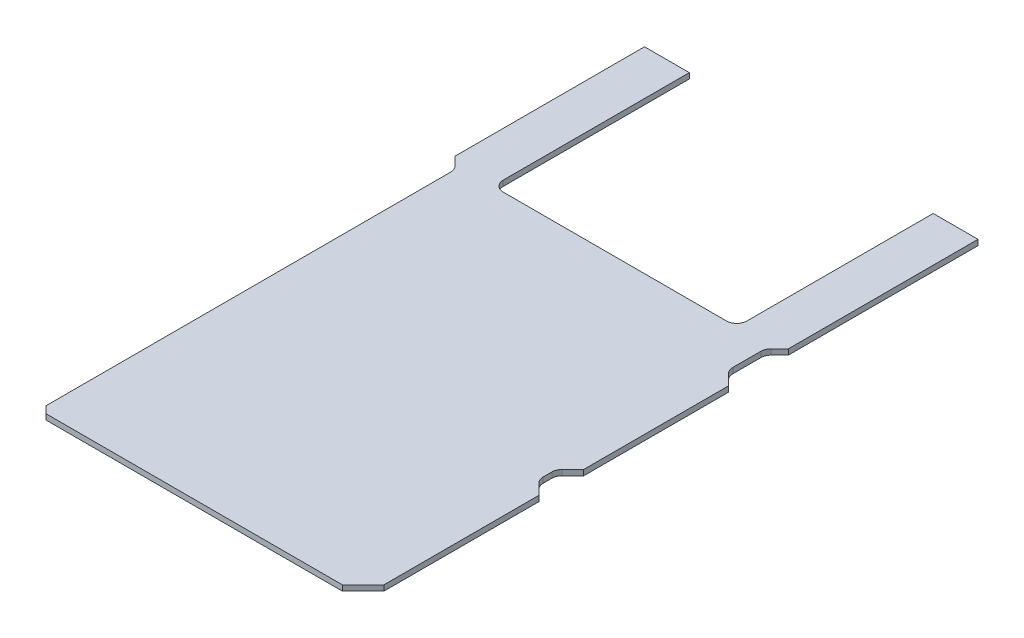
ISO-10303-21;
HEADER;
FILE_DESCRIPTION(('STEP AP214'),'2;1');
FILE_NAME('part.step','',(''),(''),'','','');
FILE_SCHEMA(('AUTOMOTIVE_DESIGN { 1 0 10303 214 1 1 1 1 }'));
ENDSEC;
DATA;
#1=APPLICATION_CONTEXT('core data for automotive mechanical design processes');
#2=APPLICATION_PROTOCOL_DEFINITION('international standard','automotive_design',2000,#1);
#3=PRODUCT_CONTEXT('',#1,'mechanical');
#4=PRODUCT('Part','Part','',(#3));
#5=PRODUCT_RELATED_PRODUCT_CATEGORY('part','',(#4));
#6=PRODUCT_DEFINITION_FORMATION('','',#4);
#7=PRODUCT_DEFINITION_CONTEXT('part definition',#1,'design');
#8=PRODUCT_DEFINITION('design','',#6,#7);
#9=PRODUCT_DEFINITION_SHAPE('','',#8);
#10=(LENGTH_UNIT() NAMED_UNIT(*) SI_UNIT(.MILLI.,.METRE.));
#11=(NAMED_UNIT(*) PLANE_ANGLE_UNIT() SI_UNIT($,.RADIAN.));
#12=(NAMED_UNIT(*) SI_UNIT($,.STERADIAN.) SOLID_ANGLE_UNIT());
#13=UNCERTAINTY_MEASURE_WITH_UNIT(LENGTH_MEASURE(1.E-05),#10,'distance_accuracy_value','');
#14=(GEOMETRIC_REPRESENTATION_CONTEXT(3) GLOBAL_UNCERTAINTY_ASSIGNED_CONTEXT((#13)) GLOBAL_UNIT_ASSIGNED_CONTEXT((#10,
#11,#12)) REPRESENTATION_CONTEXT('',''));
#15=CARTESIAN_POINT('',(0.,0.,0.));
#16=DIRECTION('',(0.,0.,1.));
#17=DIRECTION('',(1.,0.,0.));
#18=AXIS2_PLACEMENT_3D('',#15,#16,#17);
#19=CARTESIAN_POINT('',(45.,1.6,-88.5));
#20=DIRECTION('',(0.,0.,1.));
#21=DIRECTION('',(1.,0.,0.));
#22=AXIS2_PLACEMENT_3D('',#19,#20,#21);
#23=PLANE('',#22);
#24=DIRECTION('',(-1.,0.,0.));
#25=VECTOR('',#24,1.);
#26=CARTESIAN_POINT('',(45.,1.6,-88.5));
#27=LINE('',#26,#25);
#28=CARTESIAN_POINT('',(-35.3743,1.60000000000001,-88.5));
#29=VERTEX_POINT('',#28);
#30=CARTESIAN_POINT('',(-48.3743,1.6,-88.5));
#31=VERTEX_POINT('',#30);
#32=EDGE_CURVE('E221',#29,#31,#27,.T.);
#33=ORIENTED_EDGE('',*,*,#32,.F.);
#34=DIRECTION('',(0.,-1.,0.));
#35=VECTOR('',#34,1.);
#36=CARTESIAN_POINT('',(-35.3743,1.60000000000001,-88.5));
#37=LINE('',#36,#35);
#38=CARTESIAN_POINT('',(-35.3743,0.,-88.5));
#39=VERTEX_POINT('',#38);
#40=EDGE_CURVE('E232',#29,#39,#37,.T.);
#41=ORIENTED_EDGE('',*,*,#40,.T.);
#42=DIRECTION('',(-1.,0.,0.));
#43=VECTOR('',#42,1.);
#44=CARTESIAN_POINT('',(45.,0.,-88.5));
#45=LINE('',#44,#43);
#46=CARTESIAN_POINT('',(-48.3743,0.,-88.5));
#47=VERTEX_POINT('',#46);
#48=EDGE_CURVE('E261',#39,#47,#45,.T.);
#49=ORIENTED_EDGE('',*,*,#48,.T.);
#50=DIRECTION('',(0.,-1.,0.));
#51=VECTOR('',#50,1.);
#52=CARTESIAN_POINT('',(-48.3743,60.0717436115942,-88.5));
#53=LINE('',#52,#51);
#54=EDGE_CURVE('E242',#31,#47,#53,.T.);
#55=ORIENTED_EDGE('',*,*,#54,.F.);
#56=EDGE_LOOP('',(#33,#41,#49,#55));
#57=FACE_BOUND('',#56,.T.);
#58=ADVANCED_FACE('F39',(#57),#23,.F.);
#59=CARTESIAN_POINT('',(45.,1.6,88.5));
#60=DIRECTION('',(-1.,0.,0.));
#61=DIRECTION('',(0.,0.,1.));
#62=AXIS2_PLACEMENT_3D('',#59,#60,#61);
#63=PLANE('',#62);
#64=DIRECTION('',(0.,0.,-1.));
#65=VECTOR('',#64,1.);
#66=CARTESIAN_POINT('',(45.,0.,88.5));
#67=LINE('',#66,#65);
#68=CARTESIAN_POINT('',(45.,0.,34.2573593128807));
#69=VERTEX_POINT('',#68);
#70=CARTESIAN_POINT('',(45.,0.,31.7426406871193));
#71=VERTEX_POINT('',#70);
#72=EDGE_CURVE('E258',#69,#71,#67,.T.);
#73=ORIENTED_EDGE('',*,*,#72,.T.);
#74=DIRECTION('',(0.,1.,0.));
#75=VECTOR('',#74,1.);
#76=CARTESIAN_POINT('',(45.,1.6,31.7426406871193));
#77=LINE('',#76,#75);
#78=CARTESIAN_POINT('',(45.,1.6,31.7426406871193));
#79=VERTEX_POINT('',#78);
#80=EDGE_CURVE('E286',#71,#79,#77,.T.);
#81=ORIENTED_EDGE('',*,*,#80,.T.);
#82=DIRECTION('',(0.,0.,-1.));
#83=VECTOR('',#82,1.);
#84=CARTESIAN_POINT('',(45.,1.6,88.5));
#85=LINE('',#84,#83);
#86=CARTESIAN_POINT('',(45.,1.6,34.2573593128807));
#87=VERTEX_POINT('',#86);
#88=EDGE_CURVE('E245',#87,#79,#85,.T.);
#89=ORIENTED_EDGE('',*,*,#88,.F.);
#90=DIRECTION('',(0.,1.,0.));
#91=VECTOR('',#90,1.);
#92=CARTESIAN_POINT('',(45.,1.6,34.2573593128807));
#93=LINE('',#92,#91);
#94=EDGE_CURVE('E284',#87,#69,#93,.F.);
#95=ORIENTED_EDGE('',*,*,#94,.T.);
#96=EDGE_LOOP('',(#73,#81,#89,#95));
#97=FACE_BOUND('',#96,.T.);
#98=ADVANCED_FACE('F458',(#97),#63,.F.);
#99=CARTESIAN_POINT('',(45.,1.6,-20.7426406871193));
#100=VERTEX_POINT('',#99);
#101=CARTESIAN_POINT('',(45.,1.6,-28.8830593128806));
#102=VERTEX_POINT('',#101);
#103=EDGE_CURVE('E250',#100,#102,#85,.T.);
#104=ORIENTED_EDGE('',*,*,#103,.F.);
#105=DIRECTION('',(0.,1.,0.));
#106=VECTOR('',#105,1.);
#107=CARTESIAN_POINT('',(45.,1.6,-20.7426406871193));
#108=LINE('',#107,#106);
#109=CARTESIAN_POINT('',(45.,0.,-20.7426406871193));
#110=VERTEX_POINT('',#109);
#111=EDGE_CURVE('E282',#100,#110,#108,.F.);
#112=ORIENTED_EDGE('',*,*,#111,.T.);
#113=CARTESIAN_POINT('',(45.,0.,-28.8830593128806));
#114=VERTEX_POINT('',#113);
#115=EDGE_CURVE('E256',#110,#114,#67,.T.);
#116=ORIENTED_EDGE('',*,*,#115,.T.);
#117=DIRECTION('',(0.,-1.,0.));
#118=VECTOR('',#117,1.);
#119=CARTESIAN_POINT('',(45.,1.6,-28.8830593128806));
#120=LINE('',#119,#118);
#121=EDGE_CURVE('E280',#114,#102,#120,.F.);
#122=ORIENTED_EDGE('',*,*,#121,.T.);
#123=EDGE_LOOP('',(#104,#112,#116,#122));
#124=FACE_BOUND('',#123,.T.);
#125=ADVANCED_FACE('F349',(#124),#63,.F.);
#126=CARTESIAN_POINT('',(-45.,1.6,88.5));
#127=DIRECTION('',(1.,0.,0.));
#128=DIRECTION('',(0.,0.,-1.));
#129=AXIS2_PLACEMENT_3D('',#126,#127,#128);
#130=PLANE('',#129);
#131=DIRECTION('',(0.,0.,1.));
#132=VECTOR('',#131,1.);
#133=CARTESIAN_POINT('',(-45.,1.6,88.5));
#134=LINE('',#133,#132);
#135=CARTESIAN_POINT('',(-45.,1.6,-28.8830593128807));
#136=VERTEX_POINT('',#135);
#137=CARTESIAN_POINT('',(-45.,1.6,88.5));
#138=VERTEX_POINT('',#137);
#139=EDGE_CURVE('E265',#136,#138,#134,.T.);
#140=ORIENTED_EDGE('',*,*,#139,.F.);
#141=DIRECTION('',(0.,-1.,0.));
#142=VECTOR('',#141,1.);
#143=CARTESIAN_POINT('',(-45.,1.6,-28.8830593128807));
#144=LINE('',#143,#142);
#145=CARTESIAN_POINT('',(-45.,0.,-28.8830593128807));
#146=VERTEX_POINT('',#145);
#147=EDGE_CURVE('E297',#136,#146,#144,.T.);
#148=ORIENTED_EDGE('',*,*,#147,.T.);
#149=DIRECTION('',(0.,0.,1.));
#150=VECTOR('',#149,1.);
#151=CARTESIAN_POINT('',(-45.,0.,88.5));
#152=LINE('',#151,#150);
#153=CARTESIAN_POINT('',(-45.,0.,88.5));
#154=VERTEX_POINT('',#153);
#155=EDGE_CURVE('E254',#146,#154,#152,.T.);
#156=ORIENTED_EDGE('',*,*,#155,.T.);
#157=DIRECTION('',(0.,-1.,0.));
#158=VECTOR('',#157,1.);
#159=CARTESIAN_POINT('',(-45.,1.6,88.5));
#160=LINE('',#159,#158);
#161=EDGE_CURVE('E248',#138,#154,#160,.T.);
#162=ORIENTED_EDGE('',*,*,#161,.F.);
#163=EDGE_LOOP('',(#140,#148,#156,#162));
#164=FACE_BOUND('',#163,.T.);
#165=ADVANCED_FACE('F430',(#164),#130,.F.);
#166=CARTESIAN_POINT('',(48.3743,0.,-88.5));
#167=VERTEX_POINT('',#166);
#168=CARTESIAN_POINT('',(35.3743,0.,-88.5));
#169=VERTEX_POINT('',#168);
#170=EDGE_CURVE('E262',#167,#169,#45,.T.);
#171=ORIENTED_EDGE('',*,*,#170,.T.);
#172=DIRECTION('',(0.,-1.,0.));
#173=VECTOR('',#172,1.);
#174=CARTESIAN_POINT('',(35.3743,1.60000000000001,-88.5));
#175=LINE('',#174,#173);
#176=CARTESIAN_POINT('',(35.3743,1.60000000000001,-88.5));
#177=VERTEX_POINT('',#176);
#178=EDGE_CURVE('E238',#177,#169,#175,.T.);
#179=ORIENTED_EDGE('',*,*,#178,.F.);
#180=CARTESIAN_POINT('',(48.3743,1.60000000000001,-88.5));
#181=VERTEX_POINT('',#180);
#182=EDGE_CURVE('E244',#181,#177,#27,.T.);
#183=ORIENTED_EDGE('',*,*,#182,.F.);
#184=DIRECTION('',(0.,-1.,0.));
#185=VECTOR('',#184,1.);
#186=CARTESIAN_POINT('',(48.3743,60.0717436115942,-88.5));
#187=LINE('',#186,#185);
#188=EDGE_CURVE('E406',#181,#167,#187,.T.);
#189=ORIENTED_EDGE('',*,*,#188,.T.);
#190=EDGE_LOOP('',(#171,#179,#183,#189));
#191=FACE_BOUND('',#190,.T.);
#192=ADVANCED_FACE('F521',(#191),#23,.F.);
#193=CARTESIAN_POINT('',(0.,1.6,0.));
#194=DIRECTION('',(0.,1.,0.));
#195=DIRECTION('',(0.,0.,1.));
#196=AXIS2_PLACEMENT_3D('',#193,#194,#195);
#197=PLANE('',#196);
#198=DIRECTION('',(-1.,0.,0.));
#199=VECTOR('',#198,1.);
#200=CARTESIAN_POINT('',(-35.3743,1.60000000000001,-31.5));
#201=LINE('',#200,#199);
#202=CARTESIAN_POINT('',(32.3743,1.60000000000001,-31.5));
#203=VERTEX_POINT('',#202);
#204=CARTESIAN_POINT('',(-32.3743,1.60000000000001,-31.5));
#205=VERTEX_POINT('',#204);
#206=EDGE_CURVE('E239',#203,#205,#201,.T.);
#207=ORIENTED_EDGE('',*,*,#206,.T.);
#208=CARTESIAN_POINT('',(-32.3743,1.6,-34.5));
#209=DIRECTION('',(0.,1.,0.));
#210=DIRECTION('',(0.,0.,1.));
#211=AXIS2_PLACEMENT_3D('',#208,#209,#210);
#212=CIRCLE('',#211,3.);
#213=CARTESIAN_POINT('',(-35.3743,1.60000000000001,-34.5));
#214=VERTEX_POINT('',#213);
#215=EDGE_CURVE('E224',#205,#214,#212,.F.);
#216=ORIENTED_EDGE('',*,*,#215,.T.);
#217=DIRECTION('',(0.,0.,-1.));
#218=VECTOR('',#217,1.);
#219=CARTESIAN_POINT('',(-35.3743,1.60000000000001,-88.5));
#220=LINE('',#219,#218);
#221=EDGE_CURVE('E215',#214,#29,#220,.T.);
#222=ORIENTED_EDGE('',*,*,#221,.T.);
#223=ORIENTED_EDGE('',*,*,#32,.T.);
#224=DIRECTION('',(0.,0.,1.));
#225=VECTOR('',#224,1.);
#226=CARTESIAN_POINT('',(-48.3743,1.6,0.));
#227=LINE('',#226,#225);
#228=CARTESIAN_POINT('',(-48.3743,1.60000000000001,-33.5));
#229=VERTEX_POINT('',#228);
#230=EDGE_CURVE('E257',#31,#229,#227,.T.);
#231=ORIENTED_EDGE('',*,*,#230,.T.);
#232=DIRECTION('',(-0.707106781186544,0.,-0.707106781186551));
#233=VECTOR('',#232,1.);
#234=CARTESIAN_POINT('',(-7.43715000000023,1.6,7.43715000000016));
#235=LINE('',#234,#233);
#236=CARTESIAN_POINT('',(-45.8786796564404,1.6,-31.0043796564403));
#237=VERTEX_POINT('',#236);
#238=EDGE_CURVE('E419',#237,#229,#235,.T.);
#239=ORIENTED_EDGE('',*,*,#238,.F.);
#240=CARTESIAN_POINT('',(-48.,1.6,-28.8830593128807));
#241=DIRECTION('',(0.,1.,0.));
#242=DIRECTION('',(0.,0.,1.));
#243=AXIS2_PLACEMENT_3D('',#240,#241,#242);
#244=CIRCLE('',#243,3.);
#245=EDGE_CURVE('E11',#237,#136,#244,.F.);
#246=ORIENTED_EDGE('',*,*,#245,.T.);
#247=ORIENTED_EDGE('',*,*,#139,.T.);
#248=DIRECTION('',(0.707106781186546,0.,0.707106781186549));
#249=VECTOR('',#248,1.);
#250=CARTESIAN_POINT('',(-66.7500000000001,1.6,66.7499999999999));
#251=LINE('',#250,#249);
#252=CARTESIAN_POINT('',(-43.,1.6,90.5));
#253=VERTEX_POINT('',#252);
#254=EDGE_CURVE('E398',#138,#253,#251,.T.);
#255=ORIENTED_EDGE('',*,*,#254,.T.);
#256=DIRECTION('',(1.,0.,0.));
#257=VECTOR('',#256,1.);
#258=CARTESIAN_POINT('',(0.,1.6,90.5));
#259=LINE('',#258,#257);
#260=CARTESIAN_POINT('',(43.,1.6,90.5));
#261=VERTEX_POINT('',#260);
#262=EDGE_CURVE('E374',#253,#261,#259,.T.);
#263=ORIENTED_EDGE('',*,*,#262,.T.);
#264=DIRECTION('',(0.707106781186545,0.,-0.70710678118655));
#265=VECTOR('',#264,1.);
#266=CARTESIAN_POINT('',(66.7500000000002,1.6,66.7499999999997));
#267=LINE('',#266,#265);
#268=CARTESIAN_POINT('',(49.,1.6,84.5));
#269=VERTEX_POINT('',#268);
#270=EDGE_CURVE('E396',#261,#269,#267,.T.);
#271=ORIENTED_EDGE('',*,*,#270,.T.);
#272=DIRECTION('',(0.,0.,-1.));
#273=VECTOR('',#272,1.);
#274=CARTESIAN_POINT('',(49.,1.6,0.));
#275=LINE('',#274,#273);
#276=CARTESIAN_POINT('',(49.,1.6,39.5));
#277=VERTEX_POINT('',#276);
#278=EDGE_CURVE('E379',#269,#277,#275,.T.);
#279=ORIENTED_EDGE('',*,*,#278,.T.);
#280=DIRECTION('',(-0.707106781186546,0.,-0.707106781186549));
#281=VECTOR('',#280,1.);
#282=CARTESIAN_POINT('',(4.75000000000012,1.6,-4.75000000000009));
#283=LINE('',#282,#281);
#284=CARTESIAN_POINT('',(45.8786796564404,1.6,36.3786796564404));
#285=VERTEX_POINT('',#284);
#286=EDGE_CURVE('E380',#277,#285,#283,.T.);
#287=ORIENTED_EDGE('',*,*,#286,.T.);
#288=CARTESIAN_POINT('',(48.,1.6,34.2573593128807));
#289=DIRECTION('',(0.,1.,0.));
#290=DIRECTION('',(0.,0.,1.));
#291=AXIS2_PLACEMENT_3D('',#288,#289,#290);
#292=CIRCLE('',#291,3.);
#293=EDGE_CURVE('E316',#285,#87,#292,.F.);
#294=ORIENTED_EDGE('',*,*,#293,.T.);
#295=ORIENTED_EDGE('',*,*,#88,.T.);
#296=CARTESIAN_POINT('',(48.,1.6,31.7426406871193));
#297=DIRECTION('',(0.,1.,0.));
#298=DIRECTION('',(0.,0.,1.));
#299=AXIS2_PLACEMENT_3D('',#296,#297,#298);
#300=CIRCLE('',#299,3.);
#301=CARTESIAN_POINT('',(45.8786796564404,1.6,29.6213203435596));
#302=VERTEX_POINT('',#301);
#303=EDGE_CURVE('E312',#79,#302,#300,.F.);
#304=ORIENTED_EDGE('',*,*,#303,.T.);
#305=DIRECTION('',(0.707106781186549,0.,-0.707106781186546));
#306=VECTOR('',#305,1.);
#307=CARTESIAN_POINT('',(37.7499999999999,1.6,37.7500000000001));
#308=LINE('',#307,#306);
#309=CARTESIAN_POINT('',(49.,1.6,26.5));
#310=VERTEX_POINT('',#309);
#311=EDGE_CURVE('E470',#302,#310,#308,.T.);
#312=ORIENTED_EDGE('',*,*,#311,.T.);
#313=DIRECTION('',(0.,0.,-1.));
#314=VECTOR('',#313,1.);
#315=CARTESIAN_POINT('',(49.,1.6,0.));
#316=LINE('',#315,#314);
#317=CARTESIAN_POINT('',(49.,1.6,-15.5));
#318=VERTEX_POINT('',#317);
#319=EDGE_CURVE('E480',#310,#318,#316,.T.);
#320=ORIENTED_EDGE('',*,*,#319,.T.);
#321=DIRECTION('',(-0.707106781186546,0.,-0.707106781186549));
#322=VECTOR('',#321,1.);
#323=CARTESIAN_POINT('',(32.2500000000001,1.6,-32.25));
#324=LINE('',#323,#322);
#325=CARTESIAN_POINT('',(45.8786796564404,1.6,-18.6213203435596));
#326=VERTEX_POINT('',#325);
#327=EDGE_CURVE('E478',#318,#326,#324,.T.);
#328=ORIENTED_EDGE('',*,*,#327,.T.);
#329=CARTESIAN_POINT('',(48.,1.6,-20.7426406871193));
#330=DIRECTION('',(0.,1.,0.));
#331=DIRECTION('',(0.,0.,1.));
#332=AXIS2_PLACEMENT_3D('',#329,#330,#331);
#333=CIRCLE('',#332,3.);
#334=EDGE_CURVE('E308',#326,#100,#333,.F.);
#335=ORIENTED_EDGE('',*,*,#334,.T.);
#336=ORIENTED_EDGE('',*,*,#103,.T.);
#337=CARTESIAN_POINT('',(48.,1.6,-28.8830593128806));
#338=DIRECTION('',(0.,1.,0.));
#339=DIRECTION('',(0.,0.,1.));
#340=AXIS2_PLACEMENT_3D('',#337,#338,#339);
#341=CIRCLE('',#340,3.);
#342=CARTESIAN_POINT('',(45.8786796564404,1.6,-31.0043796564403));
#343=VERTEX_POINT('',#342);
#344=EDGE_CURVE('E322',#102,#343,#341,.F.);
#345=ORIENTED_EDGE('',*,*,#344,.T.);
#346=DIRECTION('',(0.707106781186551,0.,-0.707106781186544));
#347=VECTOR('',#346,1.);
#348=CARTESIAN_POINT('',(7.43714999999979,1.6,7.43714999999987));
#349=LINE('',#348,#347);
#350=CARTESIAN_POINT('',(48.3743,1.60000000000001,-33.4999999999999));
#351=VERTEX_POINT('',#350);
#352=EDGE_CURVE('E327',#343,#351,#349,.T.);
#353=ORIENTED_EDGE('',*,*,#352,.T.);
#354=DIRECTION('',(0.,0.,1.));
#355=VECTOR('',#354,1.);
#356=CARTESIAN_POINT('',(48.3743,1.6,0.));
#357=LINE('',#356,#355);
#358=EDGE_CURVE('E408',#181,#351,#357,.T.);
#359=ORIENTED_EDGE('',*,*,#358,.F.);
#360=ORIENTED_EDGE('',*,*,#182,.T.);
#361=DIRECTION('',(0.,0.,1.));
#362=VECTOR('',#361,1.);
#363=CARTESIAN_POINT('',(35.3743,1.60000000000001,-88.5));
#364=LINE('',#363,#362);
#365=CARTESIAN_POINT('',(35.3743,1.60000000000001,-34.5));
#366=VERTEX_POINT('',#365);
#367=EDGE_CURVE('E228',#177,#366,#364,.T.);
#368=ORIENTED_EDGE('',*,*,#367,.T.);
#369=CARTESIAN_POINT('',(32.3743,1.6,-34.5));
#370=DIRECTION('',(0.,1.,0.));
#371=DIRECTION('',(0.,0.,1.));
#372=AXIS2_PLACEMENT_3D('',#369,#370,#371);
#373=CIRCLE('',#372,3.);
#374=EDGE_CURVE('E306',#366,#203,#373,.F.);
#375=ORIENTED_EDGE('',*,*,#374,.T.);
#376=EDGE_LOOP('',(#207,#216,#222,#223,#231,#239,#246,#247,#255,#263,#271,#279,#287,#294,#295,
#304,#312,#320,#328,#335,#336,#345,#353,#359,#360,#368,#375));
#377=FACE_BOUND('',#376,.T.);
#378=ADVANCED_FACE('F218',(#377),#197,.T.);
#379=CARTESIAN_POINT('',(0.,0.,0.));
#380=DIRECTION('',(0.,1.,0.));
#381=DIRECTION('',(0.,0.,1.));
#382=AXIS2_PLACEMENT_3D('',#379,#380,#381);
#383=PLANE('',#382);
#384=ORIENTED_EDGE('',*,*,#48,.F.);
#385=DIRECTION('',(0.,0.,-1.));
#386=VECTOR('',#385,1.);
#387=CARTESIAN_POINT('',(-35.3743,0.,-88.5));
#388=LINE('',#387,#386);
#389=CARTESIAN_POINT('',(-35.3743,0.,-34.5));
#390=VERTEX_POINT('',#389);
#391=EDGE_CURVE('E235',#390,#39,#388,.T.);
#392=ORIENTED_EDGE('',*,*,#391,.F.);
#393=CARTESIAN_POINT('',(-32.3743,0.,-34.5));
#394=DIRECTION('',(0.,1.,0.));
#395=DIRECTION('',(0.,0.,1.));
#396=AXIS2_PLACEMENT_3D('',#393,#394,#395);
#397=CIRCLE('',#396,3.);
#398=CARTESIAN_POINT('',(-32.3743,0.,-31.5));
#399=VERTEX_POINT('',#398);
#400=EDGE_CURVE('E301',#390,#399,#397,.T.);
#401=ORIENTED_EDGE('',*,*,#400,.T.);
#402=DIRECTION('',(-1.,0.,0.));
#403=VECTOR('',#402,1.);
#404=CARTESIAN_POINT('',(-35.3743,0.,-31.5));
#405=LINE('',#404,#403);
#406=CARTESIAN_POINT('',(32.3743,0.,-31.5));
#407=VERTEX_POINT('',#406);
#408=EDGE_CURVE('E229',#407,#399,#405,.T.);
#409=ORIENTED_EDGE('',*,*,#408,.F.);
#410=CARTESIAN_POINT('',(32.3743,0.,-34.5));
#411=DIRECTION('',(0.,1.,0.));
#412=DIRECTION('',(0.,0.,1.));
#413=AXIS2_PLACEMENT_3D('',#410,#411,#412);
#414=CIRCLE('',#413,3.);
#415=CARTESIAN_POINT('',(35.3743,0.,-34.5));
#416=VERTEX_POINT('',#415);
#417=EDGE_CURVE('E304',#407,#416,#414,.T.);
#418=ORIENTED_EDGE('',*,*,#417,.T.);
#419=DIRECTION('',(0.,0.,1.));
#420=VECTOR('',#419,1.);
#421=CARTESIAN_POINT('',(35.3743,0.,-88.5));
#422=LINE('',#421,#420);
#423=EDGE_CURVE('E492',#169,#416,#422,.T.);
#424=ORIENTED_EDGE('',*,*,#423,.F.);
#425=ORIENTED_EDGE('',*,*,#170,.F.);
#426=DIRECTION('',(0.,0.,1.));
#427=VECTOR('',#426,1.);
#428=CARTESIAN_POINT('',(48.3743,0.,0.));
#429=LINE('',#428,#427);
#430=CARTESIAN_POINT('',(48.3743,0.,-33.4999999999999));
#431=VERTEX_POINT('',#430);
#432=EDGE_CURVE('E339',#167,#431,#429,.T.);
#433=ORIENTED_EDGE('',*,*,#432,.T.);
#434=DIRECTION('',(0.707106781186551,0.,-0.707106781186544));
#435=VECTOR('',#434,1.);
#436=CARTESIAN_POINT('',(7.43714999999979,0.,7.43714999999987));
#437=LINE('',#436,#435);
#438=CARTESIAN_POINT('',(45.8786796564404,0.,-31.0043796564403));
#439=VERTEX_POINT('',#438);
#440=EDGE_CURVE('E347',#439,#431,#437,.T.);
#441=ORIENTED_EDGE('',*,*,#440,.F.);
#442=CARTESIAN_POINT('',(48.,0.,-28.8830593128806));
#443=DIRECTION('',(0.,1.,0.));
#444=DIRECTION('',(0.,0.,1.));
#445=AXIS2_PLACEMENT_3D('',#442,#443,#444);
#446=CIRCLE('',#445,3.);
#447=EDGE_CURVE('E320',#439,#114,#446,.T.);
#448=ORIENTED_EDGE('',*,*,#447,.T.);
#449=ORIENTED_EDGE('',*,*,#115,.F.);
#450=CARTESIAN_POINT('',(48.,0.,-20.7426406871193));
#451=DIRECTION('',(0.,1.,0.));
#452=DIRECTION('',(0.,0.,1.));
#453=AXIS2_PLACEMENT_3D('',#450,#451,#452);
#454=CIRCLE('',#453,3.);
#455=CARTESIAN_POINT('',(45.8786796564404,0.,-18.6213203435596));
#456=VERTEX_POINT('',#455);
#457=EDGE_CURVE('E310',#110,#456,#454,.T.);
#458=ORIENTED_EDGE('',*,*,#457,.T.);
#459=DIRECTION('',(0.707106781186546,0.,0.707106781186549));
#460=VECTOR('',#459,1.);
#461=CARTESIAN_POINT('',(32.2500000000001,0.,-32.25));
#462=LINE('',#461,#460);
#463=CARTESIAN_POINT('',(49.,0.,-15.5));
#464=VERTEX_POINT('',#463);
#465=EDGE_CURVE('E355',#456,#464,#462,.T.);
#466=ORIENTED_EDGE('',*,*,#465,.T.);
#467=DIRECTION('',(0.,0.,1.));
#468=VECTOR('',#467,1.);
#469=CARTESIAN_POINT('',(49.,0.,0.));
#470=LINE('',#469,#468);
#471=CARTESIAN_POINT('',(49.,0.,26.5));
#472=VERTEX_POINT('',#471);
#473=EDGE_CURVE('E364',#464,#472,#470,.T.);
#474=ORIENTED_EDGE('',*,*,#473,.T.);
#475=DIRECTION('',(-0.707106781186549,0.,0.707106781186546));
#476=VECTOR('',#475,1.);
#477=CARTESIAN_POINT('',(37.7499999999999,0.,37.7500000000001));
#478=LINE('',#477,#476);
#479=CARTESIAN_POINT('',(45.8786796564404,0.,29.6213203435596));
#480=VERTEX_POINT('',#479);
#481=EDGE_CURVE('E368',#472,#480,#478,.T.);
#482=ORIENTED_EDGE('',*,*,#481,.T.);
#483=CARTESIAN_POINT('',(48.,0.,31.7426406871193));
#484=DIRECTION('',(0.,1.,0.));
#485=DIRECTION('',(0.,0.,1.));
#486=AXIS2_PLACEMENT_3D('',#483,#484,#485);
#487=CIRCLE('',#486,3.);
#488=EDGE_CURVE('E314',#480,#71,#487,.T.);
#489=ORIENTED_EDGE('',*,*,#488,.T.);
#490=ORIENTED_EDGE('',*,*,#72,.F.);
#491=CARTESIAN_POINT('',(48.,0.,34.2573593128807));
#492=DIRECTION('',(0.,1.,0.));
#493=DIRECTION('',(0.,0.,1.));
#494=AXIS2_PLACEMENT_3D('',#491,#492,#493);
#495=CIRCLE('',#494,3.);
#496=CARTESIAN_POINT('',(45.8786796564404,0.,36.3786796564404));
#497=VERTEX_POINT('',#496);
#498=EDGE_CURVE('E318',#69,#497,#495,.T.);
#499=ORIENTED_EDGE('',*,*,#498,.T.);
#500=DIRECTION('',(0.707106781186546,0.,0.707106781186549));
#501=VECTOR('',#500,1.);
#502=CARTESIAN_POINT('',(4.75000000000012,0.,-4.75000000000009));
#503=LINE('',#502,#501);
#504=CARTESIAN_POINT('',(49.,0.,39.5));
#505=VERTEX_POINT('',#504);
#506=EDGE_CURVE('E373',#497,#505,#503,.T.);
#507=ORIENTED_EDGE('',*,*,#506,.T.);
#508=DIRECTION('',(0.,0.,1.));
#509=VECTOR('',#508,1.);
#510=CARTESIAN_POINT('',(49.,0.,0.));
#511=LINE('',#510,#509);
#512=CARTESIAN_POINT('',(49.,0.,84.5));
#513=VERTEX_POINT('',#512);
#514=EDGE_CURVE('E375',#505,#513,#511,.T.);
#515=ORIENTED_EDGE('',*,*,#514,.T.);
#516=DIRECTION('',(-0.707106781186545,0.,0.70710678118655));
#517=VECTOR('',#516,1.);
#518=CARTESIAN_POINT('',(66.7500000000002,0.,66.7499999999997));
#519=LINE('',#518,#517);
#520=CARTESIAN_POINT('',(43.,0.,90.5));
#521=VERTEX_POINT('',#520);
#522=EDGE_CURVE('E393',#513,#521,#519,.T.);
#523=ORIENTED_EDGE('',*,*,#522,.T.);
#524=DIRECTION('',(-1.,0.,0.));
#525=VECTOR('',#524,1.);
#526=CARTESIAN_POINT('',(0.,0.,90.5));
#527=LINE('',#526,#525);
#528=CARTESIAN_POINT('',(-43.,0.,90.5));
#529=VERTEX_POINT('',#528);
#530=EDGE_CURVE('E390',#521,#529,#527,.T.);
#531=ORIENTED_EDGE('',*,*,#530,.T.);
#532=DIRECTION('',(-0.707106781186546,0.,-0.707106781186549));
#533=VECTOR('',#532,1.);
#534=CARTESIAN_POINT('',(-66.7500000000001,0.,66.7499999999999));
#535=LINE('',#534,#533);
#536=EDGE_CURVE('E387',#529,#154,#535,.T.);
#537=ORIENTED_EDGE('',*,*,#536,.T.);
#538=ORIENTED_EDGE('',*,*,#155,.F.);
#539=CARTESIAN_POINT('',(-48.,0.,-28.8830593128807));
#540=DIRECTION('',(0.,1.,0.));
#541=DIRECTION('',(0.,0.,1.));
#542=AXIS2_PLACEMENT_3D('',#539,#540,#541);
#543=CIRCLE('',#542,3.);
#544=CARTESIAN_POINT('',(-45.8786796564404,0.,-31.0043796564403));
#545=VERTEX_POINT('',#544);
#546=EDGE_CURVE('E47',#146,#545,#543,.T.);
#547=ORIENTED_EDGE('',*,*,#546,.T.);
#548=DIRECTION('',(-0.707106781186544,0.,-0.707106781186551));
#549=VECTOR('',#548,1.);
#550=CARTESIAN_POINT('',(-7.43715000000023,0.,7.43715000000016));
#551=LINE('',#550,#549);
#552=CARTESIAN_POINT('',(-48.3743,0.,-33.5));
#553=VERTEX_POINT('',#552);
#554=EDGE_CURVE('E413',#545,#553,#551,.T.);
#555=ORIENTED_EDGE('',*,*,#554,.T.);
#556=DIRECTION('',(0.,0.,1.));
#557=VECTOR('',#556,1.);
#558=CARTESIAN_POINT('',(-48.3743,0.,0.));
#559=LINE('',#558,#557);
#560=EDGE_CURVE('E416',#47,#553,#559,.T.);
#561=ORIENTED_EDGE('',*,*,#560,.F.);
#562=EDGE_LOOP('',(#384,#392,#401,#409,#418,#424,#425,#433,#441,#448,#449,#458,#466,#474,#482,
#489,#490,#499,#507,#515,#523,#531,#537,#538,#547,#555,#561));
#563=FACE_BOUND('',#562,.T.);
#564=ADVANCED_FACE('F344',(#563),#383,.F.);
#565=CARTESIAN_POINT('',(-48.3743,60.0717436115942,0.));
#566=DIRECTION('',(1.,0.,0.));
#567=DIRECTION('',(0.,0.,-1.));
#568=AXIS2_PLACEMENT_3D('',#565,#566,#567);
#569=PLANE('',#568);
#570=ORIENTED_EDGE('',*,*,#230,.F.);
#571=ORIENTED_EDGE('',*,*,#54,.T.);
#572=ORIENTED_EDGE('',*,*,#560,.T.);
#573=DIRECTION('',(0.,-1.,0.));
#574=VECTOR('',#573,1.);
#575=CARTESIAN_POINT('',(-48.3743,60.0717436115942,-33.5));
#576=LINE('',#575,#574);
#577=EDGE_CURVE('E415',#229,#553,#576,.T.);
#578=ORIENTED_EDGE('',*,*,#577,.F.);
#579=EDGE_LOOP('',(#570,#571,#572,#578));
#580=FACE_BOUND('',#579,.T.);
#581=ADVANCED_FACE('F551',(#580),#569,.F.);
#582=CARTESIAN_POINT('',(-7.43715000000023,60.0717436115942,7.43715000000016));
#583=DIRECTION('',(-0.707106781186551,0.,0.707106781186544));
#584=DIRECTION('',(0.707106781186544,0.,0.707106781186551));
#585=AXIS2_PLACEMENT_3D('',#582,#583,#584);
#586=PLANE('',#585);
#587=ORIENTED_EDGE('',*,*,#554,.F.);
#588=DIRECTION('',(0.,-1.,0.));
#589=VECTOR('',#588,1.);
#590=CARTESIAN_POINT('',(-45.8786796564404,60.0717436115942,-31.0043796564403));
#591=LINE('',#590,#589);
#592=EDGE_CURVE('E60',#545,#237,#591,.F.);
#593=ORIENTED_EDGE('',*,*,#592,.T.);
#594=ORIENTED_EDGE('',*,*,#238,.T.);
#595=ORIENTED_EDGE('',*,*,#577,.T.);
#596=EDGE_LOOP('',(#587,#593,#594,#595));
#597=FACE_BOUND('',#596,.T.);
#598=ADVANCED_FACE('F545',(#597),#586,.T.);
#599=CARTESIAN_POINT('',(7.43714999999979,60.0717436115942,7.43714999999987));
#600=DIRECTION('',(-0.707106781186544,0.,-0.707106781186551));
#601=DIRECTION('',(-0.707106781186551,0.,0.707106781186544));
#602=AXIS2_PLACEMENT_3D('',#599,#600,#601);
#603=PLANE('',#602);
#604=ORIENTED_EDGE('',*,*,#352,.F.);
#605=DIRECTION('',(0.,-1.,0.));
#606=VECTOR('',#605,1.);
#607=CARTESIAN_POINT('',(45.8786796564404,0.,-31.0043796564403));
#608=LINE('',#607,#606);
#609=EDGE_CURVE('E294',#343,#439,#608,.T.);
#610=ORIENTED_EDGE('',*,*,#609,.T.);
#611=ORIENTED_EDGE('',*,*,#440,.T.);
#612=DIRECTION('',(0.,-1.,0.));
#613=VECTOR('',#612,1.);
#614=CARTESIAN_POINT('',(48.3743,60.0717436115942,-33.4999999999999));
#615=LINE('',#614,#613);
#616=EDGE_CURVE('E338',#351,#431,#615,.T.);
#617=ORIENTED_EDGE('',*,*,#616,.F.);
#618=EDGE_LOOP('',(#604,#610,#611,#617));
#619=FACE_BOUND('',#618,.T.);
#620=ADVANCED_FACE('F335',(#619),#603,.F.);
#621=CARTESIAN_POINT('',(48.3743,60.0717436115942,0.));
#622=DIRECTION('',(1.,0.,0.));
#623=DIRECTION('',(0.,0.,-1.));
#624=AXIS2_PLACEMENT_3D('',#621,#622,#623);
#625=PLANE('',#624);
#626=ORIENTED_EDGE('',*,*,#188,.F.);
#627=ORIENTED_EDGE('',*,*,#358,.T.);
#628=ORIENTED_EDGE('',*,*,#616,.T.);
#629=ORIENTED_EDGE('',*,*,#432,.F.);
#630=EDGE_LOOP('',(#626,#627,#628,#629));
#631=FACE_BOUND('',#630,.T.);
#632=ADVANCED_FACE('F537',(#631),#625,.T.);
#633=CARTESIAN_POINT('',(0.,-90.0222194794151,90.5));
#634=DIRECTION('',(0.,0.,1.));
#635=DIRECTION('',(1.,0.,0.));
#636=AXIS2_PLACEMENT_3D('',#633,#634,#635);
#637=PLANE('',#636);
#638=ORIENTED_EDGE('',*,*,#530,.F.);
#639=DIRECTION('',(0.,1.,0.));
#640=VECTOR('',#639,1.);
#641=CARTESIAN_POINT('',(43.,-90.0222194794151,90.5));
#642=LINE('',#641,#640);
#643=EDGE_CURVE('E401',#521,#261,#642,.T.);
#644=ORIENTED_EDGE('',*,*,#643,.T.);
#645=ORIENTED_EDGE('',*,*,#262,.F.);
#646=DIRECTION('',(0.,1.,0.));
#647=VECTOR('',#646,1.);
#648=CARTESIAN_POINT('',(-43.,-90.0222194794151,90.5));
#649=LINE('',#648,#647);
#650=EDGE_CURVE('E391',#529,#253,#649,.T.);
#651=ORIENTED_EDGE('',*,*,#650,.F.);
#652=EDGE_LOOP('',(#638,#644,#645,#651));
#653=FACE_BOUND('',#652,.T.);
#654=ADVANCED_FACE('F438',(#653),#637,.T.);
#655=CARTESIAN_POINT('',(-66.7500000000001,-90.0222194794151,66.7499999999999));
#656=DIRECTION('',(-0.707106781186549,0.,0.707106781186546));
#657=DIRECTION('',(0.707106781186546,0.,0.707106781186549));
#658=AXIS2_PLACEMENT_3D('',#655,#656,#657);
#659=PLANE('',#658);
#660=ORIENTED_EDGE('',*,*,#536,.F.);
#661=ORIENTED_EDGE('',*,*,#650,.T.);
#662=ORIENTED_EDGE('',*,*,#254,.F.);
#663=ORIENTED_EDGE('',*,*,#161,.T.);
#664=EDGE_LOOP('',(#660,#661,#662,#663));
#665=FACE_BOUND('',#664,.T.);
#666=ADVANCED_FACE('F433',(#665),#659,.T.);
#667=CARTESIAN_POINT('',(66.7500000000002,-90.0222194794151,66.7499999999997));
#668=DIRECTION('',(0.70710678118655,0.,0.707106781186545));
#669=DIRECTION('',(0.707106781186545,0.,-0.70710678118655));
#670=AXIS2_PLACEMENT_3D('',#667,#668,#669);
#671=PLANE('',#670);
#672=ORIENTED_EDGE('',*,*,#522,.F.);
#673=DIRECTION('',(0.,1.,0.));
#674=VECTOR('',#673,1.);
#675=CARTESIAN_POINT('',(49.,-90.0222194794151,84.5));
#676=LINE('',#675,#674);
#677=EDGE_CURVE('E366',#513,#269,#676,.T.);
#678=ORIENTED_EDGE('',*,*,#677,.T.);
#679=ORIENTED_EDGE('',*,*,#270,.F.);
#680=ORIENTED_EDGE('',*,*,#643,.F.);
#681=EDGE_LOOP('',(#672,#678,#679,#680));
#682=FACE_BOUND('',#681,.T.);
#683=ADVANCED_FACE('F444',(#682),#671,.T.);
#684=CARTESIAN_POINT('',(49.,-90.0222194794151,0.));
#685=DIRECTION('',(1.,0.,0.));
#686=DIRECTION('',(0.,0.,-1.));
#687=AXIS2_PLACEMENT_3D('',#684,#685,#686);
#688=PLANE('',#687);
#689=ORIENTED_EDGE('',*,*,#514,.F.);
#690=DIRECTION('',(0.,1.,0.));
#691=VECTOR('',#690,1.);
#692=CARTESIAN_POINT('',(49.,-90.0222194794151,39.5));
#693=LINE('',#692,#691);
#694=EDGE_CURVE('E363',#505,#277,#693,.T.);
#695=ORIENTED_EDGE('',*,*,#694,.T.);
#696=ORIENTED_EDGE('',*,*,#278,.F.);
#697=ORIENTED_EDGE('',*,*,#677,.F.);
#698=EDGE_LOOP('',(#689,#695,#696,#697));
#699=FACE_BOUND('',#698,.T.);
#700=ADVANCED_FACE('F447',(#699),#688,.T.);
#701=CARTESIAN_POINT('',(4.75000000000012,-90.0222194794151,-4.75000000000009));
#702=DIRECTION('',(0.707106781186549,0.,-0.707106781186546));
#703=DIRECTION('',(-0.707106781186546,0.,-0.707106781186549));
#704=AXIS2_PLACEMENT_3D('',#701,#702,#703);
#705=PLANE('',#704);
#706=ORIENTED_EDGE('',*,*,#506,.F.);
#707=DIRECTION('',(0.,1.,0.));
#708=VECTOR('',#707,1.);
#709=CARTESIAN_POINT('',(45.8786796564404,-90.0222194794151,36.3786796564404));
#710=LINE('',#709,#708);
#711=EDGE_CURVE('E291',#497,#285,#710,.T.);
#712=ORIENTED_EDGE('',*,*,#711,.T.);
#713=ORIENTED_EDGE('',*,*,#286,.F.);
#714=ORIENTED_EDGE('',*,*,#694,.F.);
#715=EDGE_LOOP('',(#706,#712,#713,#714));
#716=FACE_BOUND('',#715,.T.);
#717=ADVANCED_FACE('F452',(#716),#705,.T.);
#718=CARTESIAN_POINT('',(49.,-90.0222194794151,0.));
#719=DIRECTION('',(1.,0.,0.));
#720=DIRECTION('',(0.,0.,-1.));
#721=AXIS2_PLACEMENT_3D('',#718,#719,#720);
#722=PLANE('',#721);
#723=ORIENTED_EDGE('',*,*,#473,.F.);
#724=DIRECTION('',(0.,1.,0.));
#725=VECTOR('',#724,1.);
#726=CARTESIAN_POINT('',(49.,-90.0222194794151,-15.5));
#727=LINE('',#726,#725);
#728=EDGE_CURVE('E362',#464,#318,#727,.T.);
#729=ORIENTED_EDGE('',*,*,#728,.T.);
#730=ORIENTED_EDGE('',*,*,#319,.F.);
#731=DIRECTION('',(0.,1.,0.));
#732=VECTOR('',#731,1.);
#733=CARTESIAN_POINT('',(49.,-90.0222194794151,26.5));
#734=LINE('',#733,#732);
#735=EDGE_CURVE('E476',#472,#310,#734,.T.);
#736=ORIENTED_EDGE('',*,*,#735,.F.);
#737=EDGE_LOOP('',(#723,#729,#730,#736));
#738=FACE_BOUND('',#737,.T.);
#739=ADVANCED_FACE('F581',(#738),#722,.T.);
#740=CARTESIAN_POINT('',(37.7499999999999,-90.0222194794151,37.7500000000001));
#741=DIRECTION('',(0.707106781186546,0.,0.707106781186549));
#742=DIRECTION('',(0.707106781186549,0.,-0.707106781186546));
#743=AXIS2_PLACEMENT_3D('',#740,#741,#742);
#744=PLANE('',#743);
#745=ORIENTED_EDGE('',*,*,#311,.F.);
#746=DIRECTION('',(0.,1.,0.));
#747=VECTOR('',#746,1.);
#748=CARTESIAN_POINT('',(45.8786796564404,-90.0222194794151,29.6213203435596));
#749=LINE('',#748,#747);
#750=EDGE_CURVE('E289',#302,#480,#749,.F.);
#751=ORIENTED_EDGE('',*,*,#750,.T.);
#752=ORIENTED_EDGE('',*,*,#481,.F.);
#753=ORIENTED_EDGE('',*,*,#735,.T.);
#754=EDGE_LOOP('',(#745,#751,#752,#753));
#755=FACE_BOUND('',#754,.T.);
#756=ADVANCED_FACE('F473',(#755),#744,.T.);
#757=CARTESIAN_POINT('',(32.2500000000001,-90.0222194794151,-32.25));
#758=DIRECTION('',(0.707106781186549,0.,-0.707106781186546));
#759=DIRECTION('',(-0.707106781186546,0.,-0.707106781186549));
#760=AXIS2_PLACEMENT_3D('',#757,#758,#759);
#761=PLANE('',#760);
#762=ORIENTED_EDGE('',*,*,#465,.F.);
#763=DIRECTION('',(0.,1.,0.));
#764=VECTOR('',#763,1.);
#765=CARTESIAN_POINT('',(45.8786796564404,-90.0222194794151,-18.6213203435596));
#766=LINE('',#765,#764);
#767=EDGE_CURVE('E277',#456,#326,#766,.T.);
#768=ORIENTED_EDGE('',*,*,#767,.T.);
#769=ORIENTED_EDGE('',*,*,#327,.F.);
#770=ORIENTED_EDGE('',*,*,#728,.F.);
#771=EDGE_LOOP('',(#762,#768,#769,#770));
#772=FACE_BOUND('',#771,.T.);
#773=ADVANCED_FACE('F359',(#772),#761,.T.);
#774=CARTESIAN_POINT('',(-35.3743,1.60000000000001,-88.5));
#775=DIRECTION('',(-1.,0.,0.));
#776=DIRECTION('',(0.,0.,1.));
#777=AXIS2_PLACEMENT_3D('',#774,#775,#776);
#778=PLANE('',#777);
#779=ORIENTED_EDGE('',*,*,#221,.F.);
#780=DIRECTION('',(0.,-1.,0.));
#781=VECTOR('',#780,1.);
#782=CARTESIAN_POINT('',(-35.3743,0.,-34.5));
#783=LINE('',#782,#781);
#784=EDGE_CURVE('E268',#214,#390,#783,.T.);
#785=ORIENTED_EDGE('',*,*,#784,.T.);
#786=ORIENTED_EDGE('',*,*,#391,.T.);
#787=ORIENTED_EDGE('',*,*,#40,.F.);
#788=EDGE_LOOP('',(#779,#785,#786,#787));
#789=FACE_BOUND('',#788,.T.);
#790=ADVANCED_FACE('F233',(#789),#778,.F.);
#791=CARTESIAN_POINT('',(-35.3743,1.60000000000001,-31.5));
#792=DIRECTION('',(0.,0.,1.));
#793=DIRECTION('',(1.,0.,0.));
#794=AXIS2_PLACEMENT_3D('',#791,#792,#793);
#795=PLANE('',#794);
#796=ORIENTED_EDGE('',*,*,#408,.T.);
#797=DIRECTION('',(0.,-1.,0.));
#798=VECTOR('',#797,1.);
#799=CARTESIAN_POINT('',(-32.3743,1.60000000000001,-31.5));
#800=LINE('',#799,#798);
#801=EDGE_CURVE('E273',#399,#205,#800,.F.);
#802=ORIENTED_EDGE('',*,*,#801,.T.);
#803=ORIENTED_EDGE('',*,*,#206,.F.);
#804=DIRECTION('',(0.,-1.,0.));
#805=VECTOR('',#804,1.);
#806=CARTESIAN_POINT('',(32.3743,0.,-31.5));
#807=LINE('',#806,#805);
#808=EDGE_CURVE('E270',#203,#407,#807,.T.);
#809=ORIENTED_EDGE('',*,*,#808,.T.);
#810=EDGE_LOOP('',(#796,#802,#803,#809));
#811=FACE_BOUND('',#810,.T.);
#812=ADVANCED_FACE('F505',(#811),#795,.F.);
#813=CARTESIAN_POINT('',(35.3743,1.60000000000001,-88.5));
#814=DIRECTION('',(1.,0.,0.));
#815=DIRECTION('',(0.,0.,-1.));
#816=AXIS2_PLACEMENT_3D('',#813,#814,#815);
#817=PLANE('',#816);
#818=ORIENTED_EDGE('',*,*,#423,.T.);
#819=DIRECTION('',(0.,-1.,0.));
#820=VECTOR('',#819,1.);
#821=CARTESIAN_POINT('',(35.3743,1.60000000000001,-34.5));
#822=LINE('',#821,#820);
#823=EDGE_CURVE('E275',#416,#366,#822,.F.);
#824=ORIENTED_EDGE('',*,*,#823,.T.);
#825=ORIENTED_EDGE('',*,*,#367,.F.);
#826=ORIENTED_EDGE('',*,*,#178,.T.);
#827=EDGE_LOOP('',(#818,#824,#825,#826));
#828=FACE_BOUND('',#827,.T.);
#829=ADVANCED_FACE('F510',(#828),#817,.F.);
#830=CARTESIAN_POINT('',(-32.3743,1.60000000000001,-34.5));
#831=DIRECTION('',(0.,1.,0.));
#832=DIRECTION('',(0.,0.,1.));
#833=AXIS2_PLACEMENT_3D('',#830,#831,#832);
#834=CYLINDRICAL_SURFACE('',#833,3.);
#835=ORIENTED_EDGE('',*,*,#215,.F.);
#836=ORIENTED_EDGE('',*,*,#801,.F.);
#837=ORIENTED_EDGE('',*,*,#400,.F.);
#838=ORIENTED_EDGE('',*,*,#784,.F.);
#839=EDGE_LOOP('',(#835,#836,#837,#838));
#840=FACE_BOUND('',#839,.T.);
#841=ADVANCED_FACE('F508',(#840),#834,.F.);
#842=CARTESIAN_POINT('',(32.3743,1.60000000000001,-34.5));
#843=DIRECTION('',(0.,1.,0.));
#844=DIRECTION('',(0.,0.,1.));
#845=AXIS2_PLACEMENT_3D('',#842,#843,#844);
#846=CYLINDRICAL_SURFACE('',#845,3.);
#847=ORIENTED_EDGE('',*,*,#374,.F.);
#848=ORIENTED_EDGE('',*,*,#823,.F.);
#849=ORIENTED_EDGE('',*,*,#417,.F.);
#850=ORIENTED_EDGE('',*,*,#808,.F.);
#851=EDGE_LOOP('',(#847,#848,#849,#850));
#852=FACE_BOUND('',#851,.T.);
#853=ADVANCED_FACE('F502',(#852),#846,.F.);
#854=CARTESIAN_POINT('',(48.,-90.0222194794151,-20.7426406871193));
#855=DIRECTION('',(0.,1.,0.));
#856=DIRECTION('',(0.,0.,1.));
#857=AXIS2_PLACEMENT_3D('',#854,#855,#856);
#858=CYLINDRICAL_SURFACE('',#857,3.);
#859=ORIENTED_EDGE('',*,*,#457,.F.);
#860=ORIENTED_EDGE('',*,*,#111,.F.);
#861=ORIENTED_EDGE('',*,*,#334,.F.);
#862=ORIENTED_EDGE('',*,*,#767,.F.);
#863=EDGE_LOOP('',(#859,#860,#861,#862));
#864=FACE_BOUND('',#863,.T.);
#865=ADVANCED_FACE('F352',(#864),#858,.F.);
#866=CARTESIAN_POINT('',(48.,1.6,31.7426406871193));
#867=DIRECTION('',(0.,1.,0.));
#868=DIRECTION('',(0.,0.,1.));
#869=AXIS2_PLACEMENT_3D('',#866,#867,#868);
#870=CYLINDRICAL_SURFACE('',#869,3.);
#871=ORIENTED_EDGE('',*,*,#488,.F.);
#872=ORIENTED_EDGE('',*,*,#750,.F.);
#873=ORIENTED_EDGE('',*,*,#303,.F.);
#874=ORIENTED_EDGE('',*,*,#80,.F.);
#875=EDGE_LOOP('',(#871,#872,#873,#874));
#876=FACE_BOUND('',#875,.T.);
#877=ADVANCED_FACE('F466',(#876),#870,.F.);
#878=CARTESIAN_POINT('',(48.,-90.0222194794151,34.2573593128807));
#879=DIRECTION('',(0.,1.,0.));
#880=DIRECTION('',(0.,0.,1.));
#881=AXIS2_PLACEMENT_3D('',#878,#879,#880);
#882=CYLINDRICAL_SURFACE('',#881,3.);
#883=ORIENTED_EDGE('',*,*,#498,.F.);
#884=ORIENTED_EDGE('',*,*,#94,.F.);
#885=ORIENTED_EDGE('',*,*,#293,.F.);
#886=ORIENTED_EDGE('',*,*,#711,.F.);
#887=EDGE_LOOP('',(#883,#884,#885,#886));
#888=FACE_BOUND('',#887,.T.);
#889=ADVANCED_FACE('F462',(#888),#882,.F.);
#890=CARTESIAN_POINT('',(48.,60.0717436115942,-28.8830593128806));
#891=DIRECTION('',(0.,1.,0.));
#892=DIRECTION('',(0.,0.,1.));
#893=AXIS2_PLACEMENT_3D('',#890,#891,#892);
#894=CYLINDRICAL_SURFACE('',#893,3.);
#895=ORIENTED_EDGE('',*,*,#344,.F.);
#896=ORIENTED_EDGE('',*,*,#121,.F.);
#897=ORIENTED_EDGE('',*,*,#447,.F.);
#898=ORIENTED_EDGE('',*,*,#609,.F.);
#899=EDGE_LOOP('',(#895,#896,#897,#898));
#900=FACE_BOUND('',#899,.T.);
#901=ADVANCED_FACE('F341',(#900),#894,.F.);
#902=CARTESIAN_POINT('',(-48.,1.6,-28.8830593128807));
#903=DIRECTION('',(0.,-1.,0.));
#904=DIRECTION('',(0.,0.,-1.));
#905=AXIS2_PLACEMENT_3D('',#902,#903,#904);
#906=CYLINDRICAL_SURFACE('',#905,3.);
#907=ORIENTED_EDGE('',*,*,#245,.F.);
#908=ORIENTED_EDGE('',*,*,#592,.F.);
#909=ORIENTED_EDGE('',*,*,#546,.F.);
#910=ORIENTED_EDGE('',*,*,#147,.F.);
#911=EDGE_LOOP('',(#907,#908,#909,#910));
#912=FACE_BOUND('',#911,.T.);
#913=ADVANCED_FACE('F41',(#912),#906,.F.);
#914=CLOSED_SHELL('',(#58,#98,#125,#165,#192,#378,#564,#581,#598,#620,#632,#654,#666,#683,#700,
#717,#739,#756,#773,#790,#812,#829,#841,#853,#865,#877,#889,#901,#913));
#915=MANIFOLD_SOLID_BREP('B2',#914);
#916=ADVANCED_BREP_SHAPE_REPRESENTATION('',(#18,#915),#14);
#917=SHAPE_DEFINITION_REPRESENTATION(#9,#916);
ENDSEC;
END-ISO-10303-21;
